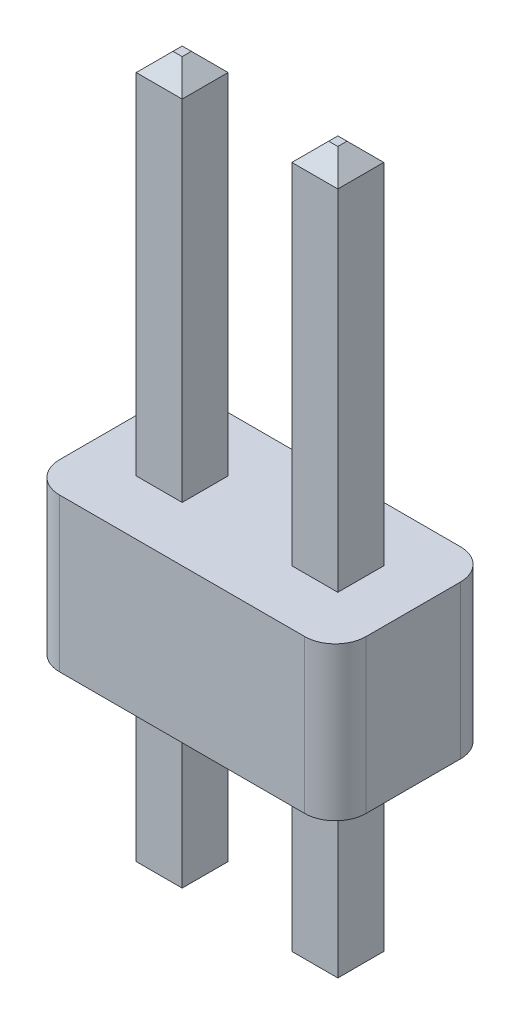
ISO-10303-21;
HEADER;
FILE_DESCRIPTION(('STEP AP214'),'2;1');
FILE_NAME('part.step','',(''),(''),'','','');
FILE_SCHEMA(('AUTOMOTIVE_DESIGN { 1 0 10303 214 1 1 1 1 }'));
ENDSEC;
DATA;
#1=APPLICATION_CONTEXT('core data for automotive mechanical design processes');
#2=APPLICATION_PROTOCOL_DEFINITION('international standard','automotive_design',2000,#1);
#3=PRODUCT_CONTEXT('',#1,'mechanical');
#4=PRODUCT('Part','Part','',(#3));
#5=PRODUCT_RELATED_PRODUCT_CATEGORY('part','',(#4));
#6=PRODUCT_DEFINITION_FORMATION('','',#4);
#7=PRODUCT_DEFINITION_CONTEXT('part definition',#1,'design');
#8=PRODUCT_DEFINITION('design','',#6,#7);
#9=PRODUCT_DEFINITION_SHAPE('','',#8);
#10=(LENGTH_UNIT() NAMED_UNIT(*) SI_UNIT(.MILLI.,.METRE.));
#11=(NAMED_UNIT(*) PLANE_ANGLE_UNIT() SI_UNIT($,.RADIAN.));
#12=(NAMED_UNIT(*) SI_UNIT($,.STERADIAN.) SOLID_ANGLE_UNIT());
#13=UNCERTAINTY_MEASURE_WITH_UNIT(LENGTH_MEASURE(1.E-05),#10,'distance_accuracy_value','');
#14=(GEOMETRIC_REPRESENTATION_CONTEXT(3) GLOBAL_UNCERTAINTY_ASSIGNED_CONTEXT((#13)) GLOBAL_UNIT_ASSIGNED_CONTEXT((#10,
#11,#12)) REPRESENTATION_CONTEXT('',''));
#15=CARTESIAN_POINT('',(0.,0.,0.));
#16=DIRECTION('',(0.,0.,1.));
#17=DIRECTION('',(1.,0.,0.));
#18=AXIS2_PLACEMENT_3D('',#15,#16,#17);
#19=CARTESIAN_POINT('',(2.,2.5,0.77));
#20=DIRECTION('',(0.,-1.,0.));
#21=DIRECTION('',(0.,0.,-1.));
#22=AXIS2_PLACEMENT_3D('',#19,#20,#21);
#23=CYLINDRICAL_SURFACE('',#22,0.5);
#24=CARTESIAN_POINT('',(2.,0.,0.77));
#25=DIRECTION('',(0.,1.,0.));
#26=DIRECTION('',(0.,0.,1.));
#27=AXIS2_PLACEMENT_3D('',#24,#25,#26);
#28=CIRCLE('',#27,0.5);
#29=CARTESIAN_POINT('',(2.,0.,1.27));
#30=VERTEX_POINT('',#29);
#31=CARTESIAN_POINT('',(2.5,0.,0.77));
#32=VERTEX_POINT('',#31);
#33=EDGE_CURVE('E302',#30,#32,#28,.T.);
#34=ORIENTED_EDGE('',*,*,#33,.T.);
#35=DIRECTION('',(0.,-1.,0.));
#36=VECTOR('',#35,1.);
#37=CARTESIAN_POINT('',(2.5,2.5,0.77));
#38=LINE('',#37,#36);
#39=CARTESIAN_POINT('',(2.5,2.5,0.77));
#40=VERTEX_POINT('',#39);
#41=EDGE_CURVE('E357',#40,#32,#38,.T.);
#42=ORIENTED_EDGE('',*,*,#41,.F.);
#43=CARTESIAN_POINT('',(2.,2.5,0.77));
#44=DIRECTION('',(0.,1.,0.));
#45=DIRECTION('',(0.,0.,1.));
#46=AXIS2_PLACEMENT_3D('',#43,#44,#45);
#47=CIRCLE('',#46,0.5);
#48=CARTESIAN_POINT('',(2.,2.5,1.27));
#49=VERTEX_POINT('',#48);
#50=EDGE_CURVE('E303',#49,#40,#47,.T.);
#51=ORIENTED_EDGE('',*,*,#50,.F.);
#52=DIRECTION('',(0.,-1.,0.));
#53=VECTOR('',#52,1.);
#54=CARTESIAN_POINT('',(2.,2.5,1.27));
#55=LINE('',#54,#53);
#56=EDGE_CURVE('E321',#49,#30,#55,.T.);
#57=ORIENTED_EDGE('',*,*,#56,.T.);
#58=EDGE_LOOP('',(#34,#42,#51,#57));
#59=FACE_BOUND('',#58,.T.);
#60=ADVANCED_FACE('F36',(#59),#23,.T.);
#61=CARTESIAN_POINT('',(2.5,2.5,-0.77));
#62=DIRECTION('',(-1.,0.,0.));
#63=DIRECTION('',(0.,0.,1.));
#64=AXIS2_PLACEMENT_3D('',#61,#62,#63);
#65=PLANE('',#64);
#66=DIRECTION('',(0.,0.,-1.));
#67=VECTOR('',#66,1.);
#68=CARTESIAN_POINT('',(2.5,0.,-0.77));
#69=LINE('',#68,#67);
#70=CARTESIAN_POINT('',(2.5,0.,-0.77));
#71=VERTEX_POINT('',#70);
#72=EDGE_CURVE('E324',#32,#71,#69,.T.);
#73=ORIENTED_EDGE('',*,*,#72,.T.);
#74=DIRECTION('',(0.,-1.,0.));
#75=VECTOR('',#74,1.);
#76=CARTESIAN_POINT('',(2.5,2.5,-0.77));
#77=LINE('',#76,#75);
#78=CARTESIAN_POINT('',(2.5,2.5,-0.77));
#79=VERTEX_POINT('',#78);
#80=EDGE_CURVE('E354',#79,#71,#77,.T.);
#81=ORIENTED_EDGE('',*,*,#80,.F.);
#82=DIRECTION('',(0.,0.,-1.));
#83=VECTOR('',#82,1.);
#84=CARTESIAN_POINT('',(2.5,2.5,-0.77));
#85=LINE('',#84,#83);
#86=EDGE_CURVE('E306',#40,#79,#85,.T.);
#87=ORIENTED_EDGE('',*,*,#86,.F.);
#88=ORIENTED_EDGE('',*,*,#41,.T.);
#89=EDGE_LOOP('',(#73,#81,#87,#88));
#90=FACE_BOUND('',#89,.T.);
#91=ADVANCED_FACE('F523',(#90),#65,.F.);
#92=CARTESIAN_POINT('',(2.,2.5,-0.77));
#93=DIRECTION('',(0.,-1.,0.));
#94=DIRECTION('',(0.,0.,-1.));
#95=AXIS2_PLACEMENT_3D('',#92,#93,#94);
#96=CYLINDRICAL_SURFACE('',#95,0.5);
#97=CARTESIAN_POINT('',(2.,0.,-0.77));
#98=DIRECTION('',(0.,1.,0.));
#99=DIRECTION('',(0.,0.,1.));
#100=AXIS2_PLACEMENT_3D('',#97,#98,#99);
#101=CIRCLE('',#100,0.5);
#102=CARTESIAN_POINT('',(2.,0.,-1.27));
#103=VERTEX_POINT('',#102);
#104=EDGE_CURVE('E326',#71,#103,#101,.T.);
#105=ORIENTED_EDGE('',*,*,#104,.T.);
#106=DIRECTION('',(0.,-1.,0.));
#107=VECTOR('',#106,1.);
#108=CARTESIAN_POINT('',(2.,2.5,-1.27));
#109=LINE('',#108,#107);
#110=CARTESIAN_POINT('',(2.,2.5,-1.27));
#111=VERTEX_POINT('',#110);
#112=EDGE_CURVE('E351',#111,#103,#109,.T.);
#113=ORIENTED_EDGE('',*,*,#112,.F.);
#114=CARTESIAN_POINT('',(2.,2.5,-0.77));
#115=DIRECTION('',(0.,1.,0.));
#116=DIRECTION('',(0.,0.,1.));
#117=AXIS2_PLACEMENT_3D('',#114,#115,#116);
#118=CIRCLE('',#117,0.5);
#119=EDGE_CURVE('E309',#79,#111,#118,.T.);
#120=ORIENTED_EDGE('',*,*,#119,.F.);
#121=ORIENTED_EDGE('',*,*,#80,.T.);
#122=EDGE_LOOP('',(#105,#113,#120,#121));
#123=FACE_BOUND('',#122,.T.);
#124=ADVANCED_FACE('F529',(#123),#96,.T.);
#125=CARTESIAN_POINT('',(-2.,2.5,-1.27));
#126=DIRECTION('',(0.,0.,1.));
#127=DIRECTION('',(1.,0.,0.));
#128=AXIS2_PLACEMENT_3D('',#125,#126,#127);
#129=PLANE('',#128);
#130=DIRECTION('',(-1.,0.,0.));
#131=VECTOR('',#130,1.);
#132=CARTESIAN_POINT('',(-2.,0.,-1.27));
#133=LINE('',#132,#131);
#134=CARTESIAN_POINT('',(-2.,0.,-1.27));
#135=VERTEX_POINT('',#134);
#136=EDGE_CURVE('E328',#103,#135,#133,.T.);
#137=ORIENTED_EDGE('',*,*,#136,.T.);
#138=DIRECTION('',(0.,-1.,0.));
#139=VECTOR('',#138,1.);
#140=CARTESIAN_POINT('',(-2.,2.5,-1.27));
#141=LINE('',#140,#139);
#142=CARTESIAN_POINT('',(-2.,2.5,-1.27));
#143=VERTEX_POINT('',#142);
#144=EDGE_CURVE('E348',#143,#135,#141,.T.);
#145=ORIENTED_EDGE('',*,*,#144,.F.);
#146=DIRECTION('',(-1.,0.,0.));
#147=VECTOR('',#146,1.);
#148=CARTESIAN_POINT('',(-2.,2.5,-1.27));
#149=LINE('',#148,#147);
#150=EDGE_CURVE('E311',#111,#143,#149,.T.);
#151=ORIENTED_EDGE('',*,*,#150,.F.);
#152=ORIENTED_EDGE('',*,*,#112,.T.);
#153=EDGE_LOOP('',(#137,#145,#151,#152));
#154=FACE_BOUND('',#153,.T.);
#155=ADVANCED_FACE('F873',(#154),#129,.F.);
#156=CARTESIAN_POINT('',(-2.,2.5,-0.77));
#157=DIRECTION('',(0.,-1.,0.));
#158=DIRECTION('',(0.,0.,-1.));
#159=AXIS2_PLACEMENT_3D('',#156,#157,#158);
#160=CYLINDRICAL_SURFACE('',#159,0.5);
#161=CARTESIAN_POINT('',(-2.,0.,-0.77));
#162=DIRECTION('',(0.,1.,0.));
#163=DIRECTION('',(0.,0.,1.));
#164=AXIS2_PLACEMENT_3D('',#161,#162,#163);
#165=CIRCLE('',#164,0.5);
#166=CARTESIAN_POINT('',(-2.5,0.,-0.77));
#167=VERTEX_POINT('',#166);
#168=EDGE_CURVE('E330',#135,#167,#165,.T.);
#169=ORIENTED_EDGE('',*,*,#168,.T.);
#170=DIRECTION('',(0.,-1.,0.));
#171=VECTOR('',#170,1.);
#172=CARTESIAN_POINT('',(-2.5,2.5,-0.77));
#173=LINE('',#172,#171);
#174=CARTESIAN_POINT('',(-2.5,2.5,-0.77));
#175=VERTEX_POINT('',#174);
#176=EDGE_CURVE('E345',#175,#167,#173,.T.);
#177=ORIENTED_EDGE('',*,*,#176,.F.);
#178=CARTESIAN_POINT('',(-2.,2.5,-0.77));
#179=DIRECTION('',(0.,1.,0.));
#180=DIRECTION('',(0.,0.,1.));
#181=AXIS2_PLACEMENT_3D('',#178,#179,#180);
#182=CIRCLE('',#181,0.5);
#183=EDGE_CURVE('E313',#143,#175,#182,.T.);
#184=ORIENTED_EDGE('',*,*,#183,.F.);
#185=ORIENTED_EDGE('',*,*,#144,.T.);
#186=EDGE_LOOP('',(#169,#177,#184,#185));
#187=FACE_BOUND('',#186,.T.);
#188=ADVANCED_FACE('F862',(#187),#160,.T.);
#189=CARTESIAN_POINT('',(-2.5,2.5,0.77));
#190=DIRECTION('',(1.,0.,0.));
#191=DIRECTION('',(0.,0.,-1.));
#192=AXIS2_PLACEMENT_3D('',#189,#190,#191);
#193=PLANE('',#192);
#194=DIRECTION('',(0.,0.,1.));
#195=VECTOR('',#194,1.);
#196=CARTESIAN_POINT('',(-2.5,0.,0.77));
#197=LINE('',#196,#195);
#198=CARTESIAN_POINT('',(-2.5,0.,0.77));
#199=VERTEX_POINT('',#198);
#200=EDGE_CURVE('E332',#167,#199,#197,.T.);
#201=ORIENTED_EDGE('',*,*,#200,.T.);
#202=DIRECTION('',(0.,-1.,0.));
#203=VECTOR('',#202,1.);
#204=CARTESIAN_POINT('',(-2.5,2.5,0.77));
#205=LINE('',#204,#203);
#206=CARTESIAN_POINT('',(-2.5,2.5,0.77));
#207=VERTEX_POINT('',#206);
#208=EDGE_CURVE('E342',#207,#199,#205,.T.);
#209=ORIENTED_EDGE('',*,*,#208,.F.);
#210=DIRECTION('',(0.,0.,1.));
#211=VECTOR('',#210,1.);
#212=CARTESIAN_POINT('',(-2.5,2.5,0.77));
#213=LINE('',#212,#211);
#214=EDGE_CURVE('E315',#175,#207,#213,.T.);
#215=ORIENTED_EDGE('',*,*,#214,.F.);
#216=ORIENTED_EDGE('',*,*,#176,.T.);
#217=EDGE_LOOP('',(#201,#209,#215,#216));
#218=FACE_BOUND('',#217,.T.);
#219=ADVANCED_FACE('F851',(#218),#193,.F.);
#220=CARTESIAN_POINT('',(-2.,2.5,0.77));
#221=DIRECTION('',(0.,-1.,0.));
#222=DIRECTION('',(0.,0.,-1.));
#223=AXIS2_PLACEMENT_3D('',#220,#221,#222);
#224=CYLINDRICAL_SURFACE('',#223,0.5);
#225=CARTESIAN_POINT('',(-2.,0.,0.77));
#226=DIRECTION('',(0.,1.,0.));
#227=DIRECTION('',(0.,0.,1.));
#228=AXIS2_PLACEMENT_3D('',#225,#226,#227);
#229=CIRCLE('',#228,0.5);
#230=CARTESIAN_POINT('',(-2.,0.,1.27));
#231=VERTEX_POINT('',#230);
#232=EDGE_CURVE('E334',#199,#231,#229,.T.);
#233=ORIENTED_EDGE('',*,*,#232,.T.);
#234=DIRECTION('',(0.,-1.,0.));
#235=VECTOR('',#234,1.);
#236=CARTESIAN_POINT('',(-2.,2.5,1.27));
#237=LINE('',#236,#235);
#238=CARTESIAN_POINT('',(-2.,2.5,1.27));
#239=VERTEX_POINT('',#238);
#240=EDGE_CURVE('E339',#239,#231,#237,.T.);
#241=ORIENTED_EDGE('',*,*,#240,.F.);
#242=CARTESIAN_POINT('',(-2.,2.5,0.77));
#243=DIRECTION('',(0.,1.,0.));
#244=DIRECTION('',(0.,0.,1.));
#245=AXIS2_PLACEMENT_3D('',#242,#243,#244);
#246=CIRCLE('',#245,0.5);
#247=EDGE_CURVE('E317',#207,#239,#246,.T.);
#248=ORIENTED_EDGE('',*,*,#247,.F.);
#249=ORIENTED_EDGE('',*,*,#208,.T.);
#250=EDGE_LOOP('',(#233,#241,#248,#249));
#251=FACE_BOUND('',#250,.T.);
#252=ADVANCED_FACE('F840',(#251),#224,.T.);
#253=CARTESIAN_POINT('',(2.,2.5,1.27));
#254=DIRECTION('',(0.,0.,-1.));
#255=DIRECTION('',(-1.,0.,0.));
#256=AXIS2_PLACEMENT_3D('',#253,#254,#255);
#257=PLANE('',#256);
#258=DIRECTION('',(1.,0.,0.));
#259=VECTOR('',#258,1.);
#260=CARTESIAN_POINT('',(2.,0.,1.27));
#261=LINE('',#260,#259);
#262=EDGE_CURVE('E307',#231,#30,#261,.T.);
#263=ORIENTED_EDGE('',*,*,#262,.T.);
#264=ORIENTED_EDGE('',*,*,#56,.F.);
#265=DIRECTION('',(1.,0.,0.));
#266=VECTOR('',#265,1.);
#267=CARTESIAN_POINT('',(2.,2.5,1.27));
#268=LINE('',#267,#266);
#269=EDGE_CURVE('E319',#239,#49,#268,.T.);
#270=ORIENTED_EDGE('',*,*,#269,.F.);
#271=ORIENTED_EDGE('',*,*,#240,.T.);
#272=EDGE_LOOP('',(#263,#264,#270,#271));
#273=FACE_BOUND('',#272,.T.);
#274=ADVANCED_FACE('F830',(#273),#257,.F.);
#275=CARTESIAN_POINT('',(2.,2.5,0.77));
#276=DIRECTION('',(0.,1.,0.));
#277=DIRECTION('',(0.,0.,1.));
#278=AXIS2_PLACEMENT_3D('',#275,#276,#277);
#279=PLANE('',#278);
#280=DIRECTION('',(0.,0.,1.));
#281=VECTOR('',#280,1.);
#282=CARTESIAN_POINT('',(0.895,2.5,0.77));
#283=LINE('',#282,#281);
#284=CARTESIAN_POINT('',(0.895,2.5,-0.375));
#285=VERTEX_POINT('',#284);
#286=CARTESIAN_POINT('',(0.895,2.5,0.375));
#287=VERTEX_POINT('',#286);
#288=EDGE_CURVE('E276',#285,#287,#283,.T.);
#289=ORIENTED_EDGE('',*,*,#288,.F.);
#290=DIRECTION('',(-1.,0.,0.));
#291=VECTOR('',#290,1.);
#292=CARTESIAN_POINT('',(2.,2.5,-0.375));
#293=LINE('',#292,#291);
#294=CARTESIAN_POINT('',(1.645,2.5,-0.375));
#295=VERTEX_POINT('',#294);
#296=EDGE_CURVE('E254',#295,#285,#293,.T.);
#297=ORIENTED_EDGE('',*,*,#296,.F.);
#298=DIRECTION('',(0.,0.,-1.));
#299=VECTOR('',#298,1.);
#300=CARTESIAN_POINT('',(1.645,2.5,0.77));
#301=LINE('',#300,#299);
#302=CARTESIAN_POINT('',(1.645,2.5,0.375));
#303=VERTEX_POINT('',#302);
#304=EDGE_CURVE('E247',#303,#295,#301,.T.);
#305=ORIENTED_EDGE('',*,*,#304,.F.);
#306=DIRECTION('',(1.,0.,0.));
#307=VECTOR('',#306,1.);
#308=CARTESIAN_POINT('',(2.,2.5,0.375));
#309=LINE('',#308,#307);
#310=EDGE_CURVE('E251',#287,#303,#309,.T.);
#311=ORIENTED_EDGE('',*,*,#310,.F.);
#312=EDGE_LOOP('',(#289,#297,#305,#311));
#313=FACE_BOUND('',#312,.T.);
#314=DIRECTION('',(0.,0.,-1.));
#315=VECTOR('',#314,1.);
#316=CARTESIAN_POINT('',(-0.895,2.5,0.77));
#317=LINE('',#316,#315);
#318=CARTESIAN_POINT('',(-0.895,2.5,0.375));
#319=VERTEX_POINT('',#318);
#320=CARTESIAN_POINT('',(-0.895,2.5,-0.375));
#321=VERTEX_POINT('',#320);
#322=EDGE_CURVE('E299',#319,#321,#317,.T.);
#323=ORIENTED_EDGE('',*,*,#322,.F.);
#324=DIRECTION('',(1.,0.,0.));
#325=VECTOR('',#324,1.);
#326=CARTESIAN_POINT('',(2.,2.5,0.375));
#327=LINE('',#326,#325);
#328=CARTESIAN_POINT('',(-1.645,2.5,0.375));
#329=VERTEX_POINT('',#328);
#330=EDGE_CURVE('E296',#329,#319,#327,.T.);
#331=ORIENTED_EDGE('',*,*,#330,.F.);
#332=DIRECTION('',(0.,0.,1.));
#333=VECTOR('',#332,1.);
#334=CARTESIAN_POINT('',(-1.645,2.5,0.77));
#335=LINE('',#334,#333);
#336=CARTESIAN_POINT('',(-1.645,2.5,-0.375));
#337=VERTEX_POINT('',#336);
#338=EDGE_CURVE('E293',#337,#329,#335,.T.);
#339=ORIENTED_EDGE('',*,*,#338,.F.);
#340=DIRECTION('',(-1.,0.,0.));
#341=VECTOR('',#340,1.);
#342=CARTESIAN_POINT('',(2.,2.5,-0.375));
#343=LINE('',#342,#341);
#344=EDGE_CURVE('E281',#321,#337,#343,.T.);
#345=ORIENTED_EDGE('',*,*,#344,.F.);
#346=EDGE_LOOP('',(#323,#331,#339,#345));
#347=FACE_BOUND('',#346,.T.);
#348=ORIENTED_EDGE('',*,*,#50,.T.);
#349=ORIENTED_EDGE('',*,*,#86,.T.);
#350=ORIENTED_EDGE('',*,*,#119,.T.);
#351=ORIENTED_EDGE('',*,*,#150,.T.);
#352=ORIENTED_EDGE('',*,*,#183,.T.);
#353=ORIENTED_EDGE('',*,*,#214,.T.);
#354=ORIENTED_EDGE('',*,*,#247,.T.);
#355=ORIENTED_EDGE('',*,*,#269,.T.);
#356=EDGE_LOOP('',(#348,#349,#350,#351,#352,#353,#354,#355));
#357=FACE_BOUND('',#356,.T.);
#358=ADVANCED_FACE('F249',(#313,#347,#357),#279,.T.);
#359=CARTESIAN_POINT('',(2.,0.,0.77));
#360=DIRECTION('',(0.,1.,0.));
#361=DIRECTION('',(0.,0.,1.));
#362=AXIS2_PLACEMENT_3D('',#359,#360,#361);
#363=PLANE('',#362);
#364=DIRECTION('',(-1.,0.,0.));
#365=VECTOR('',#364,1.);
#366=CARTESIAN_POINT('',(2.,0.,-0.375));
#367=LINE('',#366,#365);
#368=CARTESIAN_POINT('',(1.645,0.,-0.375));
#369=VERTEX_POINT('',#368);
#370=CARTESIAN_POINT('',(0.895,0.,-0.375));
#371=VERTEX_POINT('',#370);
#372=EDGE_CURVE('E378',#369,#371,#367,.T.);
#373=ORIENTED_EDGE('',*,*,#372,.T.);
#374=DIRECTION('',(0.,0.,1.));
#375=VECTOR('',#374,1.);
#376=CARTESIAN_POINT('',(0.895,0.,0.77));
#377=LINE('',#376,#375);
#378=CARTESIAN_POINT('',(0.895,0.,0.375));
#379=VERTEX_POINT('',#378);
#380=EDGE_CURVE('E381',#371,#379,#377,.T.);
#381=ORIENTED_EDGE('',*,*,#380,.T.);
#382=DIRECTION('',(1.,0.,0.));
#383=VECTOR('',#382,1.);
#384=CARTESIAN_POINT('',(2.,0.,0.375));
#385=LINE('',#384,#383);
#386=CARTESIAN_POINT('',(1.645,0.,0.375));
#387=VERTEX_POINT('',#386);
#388=EDGE_CURVE('E372',#379,#387,#385,.T.);
#389=ORIENTED_EDGE('',*,*,#388,.T.);
#390=DIRECTION('',(0.,0.,-1.));
#391=VECTOR('',#390,1.);
#392=CARTESIAN_POINT('',(1.645,0.,0.77));
#393=LINE('',#392,#391);
#394=EDGE_CURVE('E375',#387,#369,#393,.T.);
#395=ORIENTED_EDGE('',*,*,#394,.T.);
#396=EDGE_LOOP('',(#373,#381,#389,#395));
#397=FACE_BOUND('',#396,.T.);
#398=DIRECTION('',(1.,0.,0.));
#399=VECTOR('',#398,1.);
#400=CARTESIAN_POINT('',(2.,0.,0.375));
#401=LINE('',#400,#399);
#402=CARTESIAN_POINT('',(-1.645,0.,0.375));
#403=VERTEX_POINT('',#402);
#404=CARTESIAN_POINT('',(-0.895,0.,0.375));
#405=VERTEX_POINT('',#404);
#406=EDGE_CURVE('E366',#403,#405,#401,.T.);
#407=ORIENTED_EDGE('',*,*,#406,.T.);
#408=DIRECTION('',(0.,0.,-1.));
#409=VECTOR('',#408,1.);
#410=CARTESIAN_POINT('',(-0.895,0.,0.77));
#411=LINE('',#410,#409);
#412=CARTESIAN_POINT('',(-0.895,0.,-0.375));
#413=VERTEX_POINT('',#412);
#414=EDGE_CURVE('E369',#405,#413,#411,.T.);
#415=ORIENTED_EDGE('',*,*,#414,.T.);
#416=DIRECTION('',(-1.,0.,0.));
#417=VECTOR('',#416,1.);
#418=CARTESIAN_POINT('',(2.,0.,-0.375));
#419=LINE('',#418,#417);
#420=CARTESIAN_POINT('',(-1.645,0.,-0.375));
#421=VERTEX_POINT('',#420);
#422=EDGE_CURVE('E360',#413,#421,#419,.T.);
#423=ORIENTED_EDGE('',*,*,#422,.T.);
#424=DIRECTION('',(0.,0.,1.));
#425=VECTOR('',#424,1.);
#426=CARTESIAN_POINT('',(-1.645,0.,0.77));
#427=LINE('',#426,#425);
#428=EDGE_CURVE('E363',#421,#403,#427,.T.);
#429=ORIENTED_EDGE('',*,*,#428,.T.);
#430=EDGE_LOOP('',(#407,#415,#423,#429));
#431=FACE_BOUND('',#430,.T.);
#432=ORIENTED_EDGE('',*,*,#33,.F.);
#433=ORIENTED_EDGE('',*,*,#262,.F.);
#434=ORIENTED_EDGE('',*,*,#232,.F.);
#435=ORIENTED_EDGE('',*,*,#200,.F.);
#436=ORIENTED_EDGE('',*,*,#168,.F.);
#437=ORIENTED_EDGE('',*,*,#136,.F.);
#438=ORIENTED_EDGE('',*,*,#104,.F.);
#439=ORIENTED_EDGE('',*,*,#72,.F.);
#440=EDGE_LOOP('',(#432,#433,#434,#435,#436,#437,#438,#439));
#441=FACE_BOUND('',#440,.T.);
#442=ADVANCED_FACE('F809',(#397,#431,#441),#363,.F.);
#443=CARTESIAN_POINT('',(0.,-3.25,0.));
#444=DIRECTION('',(0.,-1.,0.));
#445=DIRECTION('',(0.,0.,-1.));
#446=AXIS2_PLACEMENT_3D('',#443,#444,#445);
#447=PLANE('',#446);
#448=DIRECTION('',(0.,0.,1.));
#449=VECTOR('',#448,1.);
#450=CARTESIAN_POINT('',(-1.195,-3.25,0.));
#451=LINE('',#450,#449);
#452=CARTESIAN_POINT('',(-1.195,-3.25,-0.0750000000000004));
#453=VERTEX_POINT('',#452);
#454=CARTESIAN_POINT('',(-1.195,-3.25,0.075));
#455=VERTEX_POINT('',#454);
#456=EDGE_CURVE('E407',#453,#455,#451,.T.);
#457=ORIENTED_EDGE('',*,*,#456,.T.);
#458=DIRECTION('',(-1.,0.,0.));
#459=VECTOR('',#458,1.);
#460=CARTESIAN_POINT('',(0.,-3.25,0.075));
#461=LINE('',#460,#459);
#462=CARTESIAN_POINT('',(-1.345,-3.25,0.075));
#463=VERTEX_POINT('',#462);
#464=EDGE_CURVE('E411',#455,#463,#461,.T.);
#465=ORIENTED_EDGE('',*,*,#464,.T.);
#466=DIRECTION('',(0.,0.,-1.));
#467=VECTOR('',#466,1.);
#468=CARTESIAN_POINT('',(-1.345,-3.25,0.));
#469=LINE('',#468,#467);
#470=CARTESIAN_POINT('',(-1.345,-3.25,-0.0750000000000004));
#471=VERTEX_POINT('',#470);
#472=EDGE_CURVE('E409',#463,#471,#469,.T.);
#473=ORIENTED_EDGE('',*,*,#472,.T.);
#474=DIRECTION('',(1.,0.,0.));
#475=VECTOR('',#474,1.);
#476=CARTESIAN_POINT('',(0.,-3.25,-0.0750000000000004));
#477=LINE('',#476,#475);
#478=EDGE_CURVE('E405',#471,#453,#477,.T.);
#479=ORIENTED_EDGE('',*,*,#478,.T.);
#480=EDGE_LOOP('',(#457,#465,#473,#479));
#481=FACE_BOUND('',#480,.T.);
#482=ADVANCED_FACE('F800',(#481),#447,.T.);
#483=CARTESIAN_POINT('',(-1.645,-3.25,-0.375));
#484=DIRECTION('',(0.,0.,-1.));
#485=DIRECTION('',(-1.,0.,0.));
#486=AXIS2_PLACEMENT_3D('',#483,#484,#485);
#487=PLANE('',#486);
#488=DIRECTION('',(0.,1.,0.));
#489=VECTOR('',#488,1.);
#490=CARTESIAN_POINT('',(-0.895,-3.25,-0.375));
#491=LINE('',#490,#489);
#492=CARTESIAN_POINT('',(-0.895,-2.95,-0.375));
#493=VERTEX_POINT('',#492);
#494=EDGE_CURVE('E289',#493,#413,#491,.T.);
#495=ORIENTED_EDGE('',*,*,#494,.F.);
#496=DIRECTION('',(-1.,0.,0.));
#497=VECTOR('',#496,1.);
#498=CARTESIAN_POINT('',(-1.645,-2.95,-0.375));
#499=LINE('',#498,#497);
#500=CARTESIAN_POINT('',(-1.645,-2.95,-0.375));
#501=VERTEX_POINT('',#500);
#502=EDGE_CURVE('E418',#493,#501,#499,.T.);
#503=ORIENTED_EDGE('',*,*,#502,.T.);
#504=DIRECTION('',(0.,1.,0.));
#505=VECTOR('',#504,1.);
#506=CARTESIAN_POINT('',(-1.645,-3.25,-0.375));
#507=LINE('',#506,#505);
#508=EDGE_CURVE('E286',#501,#421,#507,.T.);
#509=ORIENTED_EDGE('',*,*,#508,.T.);
#510=ORIENTED_EDGE('',*,*,#422,.F.);
#511=EDGE_LOOP('',(#495,#503,#509,#510));
#512=FACE_BOUND('',#511,.T.);
#513=ADVANCED_FACE('F736',(#512),#487,.T.);
#514=CARTESIAN_POINT('',(-1.645,-3.25,0.375));
#515=DIRECTION('',(-1.,0.,0.));
#516=DIRECTION('',(0.,0.,1.));
#517=AXIS2_PLACEMENT_3D('',#514,#515,#516);
#518=PLANE('',#517);
#519=ORIENTED_EDGE('',*,*,#508,.F.);
#520=DIRECTION('',(0.,0.,1.));
#521=VECTOR('',#520,1.);
#522=CARTESIAN_POINT('',(-1.645,-2.95,0.375));
#523=LINE('',#522,#521);
#524=CARTESIAN_POINT('',(-1.645,-2.95,0.375));
#525=VERTEX_POINT('',#524);
#526=EDGE_CURVE('E414',#501,#525,#523,.T.);
#527=ORIENTED_EDGE('',*,*,#526,.T.);
#528=DIRECTION('',(0.,1.,0.));
#529=VECTOR('',#528,1.);
#530=CARTESIAN_POINT('',(-1.645,-3.25,0.375));
#531=LINE('',#530,#529);
#532=EDGE_CURVE('E283',#525,#403,#531,.T.);
#533=ORIENTED_EDGE('',*,*,#532,.T.);
#534=ORIENTED_EDGE('',*,*,#428,.F.);
#535=EDGE_LOOP('',(#519,#527,#533,#534));
#536=FACE_BOUND('',#535,.T.);
#537=ADVANCED_FACE('F747',(#536),#518,.T.);
#538=CARTESIAN_POINT('',(-0.895,-3.25,0.375));
#539=DIRECTION('',(0.,0.,1.));
#540=DIRECTION('',(1.,0.,0.));
#541=AXIS2_PLACEMENT_3D('',#538,#539,#540);
#542=PLANE('',#541);
#543=ORIENTED_EDGE('',*,*,#532,.F.);
#544=DIRECTION('',(1.,0.,0.));
#545=VECTOR('',#544,1.);
#546=CARTESIAN_POINT('',(-0.895,-2.95,0.375));
#547=LINE('',#546,#545);
#548=CARTESIAN_POINT('',(-0.895,-2.95,0.375));
#549=VERTEX_POINT('',#548);
#550=EDGE_CURVE('E402',#525,#549,#547,.T.);
#551=ORIENTED_EDGE('',*,*,#550,.T.);
#552=DIRECTION('',(0.,1.,0.));
#553=VECTOR('',#552,1.);
#554=CARTESIAN_POINT('',(-0.895,-3.25,0.375));
#555=LINE('',#554,#553);
#556=EDGE_CURVE('E279',#549,#405,#555,.T.);
#557=ORIENTED_EDGE('',*,*,#556,.T.);
#558=ORIENTED_EDGE('',*,*,#406,.F.);
#559=EDGE_LOOP('',(#543,#551,#557,#558));
#560=FACE_BOUND('',#559,.T.);
#561=ADVANCED_FACE('F758',(#560),#542,.T.);
#562=CARTESIAN_POINT('',(-0.895,-3.25,-0.375));
#563=DIRECTION('',(1.,0.,0.));
#564=DIRECTION('',(0.,0.,-1.));
#565=AXIS2_PLACEMENT_3D('',#562,#563,#564);
#566=PLANE('',#565);
#567=ORIENTED_EDGE('',*,*,#556,.F.);
#568=DIRECTION('',(0.,0.,-1.));
#569=VECTOR('',#568,1.);
#570=CARTESIAN_POINT('',(-0.895,-2.95,-0.375));
#571=LINE('',#570,#569);
#572=EDGE_CURVE('E416',#549,#493,#571,.T.);
#573=ORIENTED_EDGE('',*,*,#572,.T.);
#574=ORIENTED_EDGE('',*,*,#494,.T.);
#575=ORIENTED_EDGE('',*,*,#414,.F.);
#576=EDGE_LOOP('',(#567,#573,#574,#575));
#577=FACE_BOUND('',#576,.T.);
#578=ADVANCED_FACE('F766',(#577),#566,.T.);
#579=CARTESIAN_POINT('',(-0.895,8.2,-0.375));
#580=VERTEX_POINT('',#579);
#581=EDGE_CURVE('E278',#321,#580,#491,.T.);
#582=ORIENTED_EDGE('',*,*,#581,.T.);
#583=DIRECTION('',(0.,0.,1.));
#584=VECTOR('',#583,1.);
#585=CARTESIAN_POINT('',(-0.895,8.2,0.375));
#586=LINE('',#585,#584);
#587=CARTESIAN_POINT('',(-0.895,8.2,0.375));
#588=VERTEX_POINT('',#587);
#589=EDGE_CURVE('E434',#580,#588,#586,.T.);
#590=ORIENTED_EDGE('',*,*,#589,.T.);
#591=EDGE_CURVE('E282',#319,#588,#555,.T.);
#592=ORIENTED_EDGE('',*,*,#591,.F.);
#593=ORIENTED_EDGE('',*,*,#322,.T.);
#594=EDGE_LOOP('',(#582,#590,#592,#593));
#595=FACE_BOUND('',#594,.T.);
#596=ADVANCED_FACE('F755',(#595),#566,.T.);
#597=ORIENTED_EDGE('',*,*,#591,.T.);
#598=DIRECTION('',(-1.,0.,0.));
#599=VECTOR('',#598,1.);
#600=CARTESIAN_POINT('',(-1.645,8.2,0.375));
#601=LINE('',#600,#599);
#602=CARTESIAN_POINT('',(-1.645,8.2,0.375));
#603=VERTEX_POINT('',#602);
#604=EDGE_CURVE('E436',#588,#603,#601,.T.);
#605=ORIENTED_EDGE('',*,*,#604,.T.);
#606=EDGE_CURVE('E285',#329,#603,#531,.T.);
#607=ORIENTED_EDGE('',*,*,#606,.F.);
#608=ORIENTED_EDGE('',*,*,#330,.T.);
#609=EDGE_LOOP('',(#597,#605,#607,#608));
#610=FACE_BOUND('',#609,.T.);
#611=ADVANCED_FACE('F744',(#610),#542,.T.);
#612=ORIENTED_EDGE('',*,*,#606,.T.);
#613=DIRECTION('',(0.,0.,-1.));
#614=VECTOR('',#613,1.);
#615=CARTESIAN_POINT('',(-1.645,8.2,-0.375));
#616=LINE('',#615,#614);
#617=CARTESIAN_POINT('',(-1.645,8.2,-0.375));
#618=VERTEX_POINT('',#617);
#619=EDGE_CURVE('E429',#603,#618,#616,.T.);
#620=ORIENTED_EDGE('',*,*,#619,.T.);
#621=EDGE_CURVE('E288',#337,#618,#507,.T.);
#622=ORIENTED_EDGE('',*,*,#621,.F.);
#623=ORIENTED_EDGE('',*,*,#338,.T.);
#624=EDGE_LOOP('',(#612,#620,#622,#623));
#625=FACE_BOUND('',#624,.T.);
#626=ADVANCED_FACE('F733',(#625),#518,.T.);
#627=ORIENTED_EDGE('',*,*,#621,.T.);
#628=DIRECTION('',(1.,0.,0.));
#629=VECTOR('',#628,1.);
#630=CARTESIAN_POINT('',(-0.895,8.2,-0.375));
#631=LINE('',#630,#629);
#632=EDGE_CURVE('E432',#618,#580,#631,.T.);
#633=ORIENTED_EDGE('',*,*,#632,.T.);
#634=ORIENTED_EDGE('',*,*,#581,.F.);
#635=ORIENTED_EDGE('',*,*,#344,.T.);
#636=EDGE_LOOP('',(#627,#633,#634,#635));
#637=FACE_BOUND('',#636,.T.);
#638=ADVANCED_FACE('F723',(#637),#487,.T.);
#639=CARTESIAN_POINT('',(0.,8.5,0.));
#640=DIRECTION('',(0.,-1.,0.));
#641=DIRECTION('',(0.,0.,-1.));
#642=AXIS2_PLACEMENT_3D('',#639,#640,#641);
#643=PLANE('',#642);
#644=DIRECTION('',(-1.,0.,0.));
#645=VECTOR('',#644,1.);
#646=CARTESIAN_POINT('',(-1.645,8.5,-0.0750000000000004));
#647=LINE('',#646,#645);
#648=CARTESIAN_POINT('',(-1.195,8.5,-0.0750000000000004));
#649=VERTEX_POINT('',#648);
#650=CARTESIAN_POINT('',(-1.345,8.5,-0.0750000000000004));
#651=VERTEX_POINT('',#650);
#652=EDGE_CURVE('E424',#649,#651,#647,.T.);
#653=ORIENTED_EDGE('',*,*,#652,.T.);
#654=DIRECTION('',(0.,0.,1.));
#655=VECTOR('',#654,1.);
#656=CARTESIAN_POINT('',(-1.345,8.5,0.375));
#657=LINE('',#656,#655);
#658=CARTESIAN_POINT('',(-1.345,8.5,0.075));
#659=VERTEX_POINT('',#658);
#660=EDGE_CURVE('E426',#651,#659,#657,.T.);
#661=ORIENTED_EDGE('',*,*,#660,.T.);
#662=DIRECTION('',(1.,0.,0.));
#663=VECTOR('',#662,1.);
#664=CARTESIAN_POINT('',(-0.895,8.5,0.075));
#665=LINE('',#664,#663);
#666=CARTESIAN_POINT('',(-1.195,8.5,0.075));
#667=VERTEX_POINT('',#666);
#668=EDGE_CURVE('E420',#659,#667,#665,.T.);
#669=ORIENTED_EDGE('',*,*,#668,.T.);
#670=DIRECTION('',(0.,0.,-1.));
#671=VECTOR('',#670,1.);
#672=CARTESIAN_POINT('',(-1.195,8.5,-0.375));
#673=LINE('',#672,#671);
#674=EDGE_CURVE('E422',#667,#649,#673,.T.);
#675=ORIENTED_EDGE('',*,*,#674,.T.);
#676=EDGE_LOOP('',(#653,#661,#669,#675));
#677=FACE_BOUND('',#676,.T.);
#678=ADVANCED_FACE('F714',(#677),#643,.F.);
#679=CARTESIAN_POINT('',(0.,-3.25,0.));
#680=DIRECTION('',(0.,-1.,0.));
#681=DIRECTION('',(0.,0.,-1.));
#682=AXIS2_PLACEMENT_3D('',#679,#680,#681);
#683=PLANE('',#682);
#684=DIRECTION('',(0.,0.,-1.));
#685=VECTOR('',#684,1.);
#686=CARTESIAN_POINT('',(1.195,-3.25,0.));
#687=LINE('',#686,#685);
#688=CARTESIAN_POINT('',(1.195,-3.25,0.0750000000000002));
#689=VERTEX_POINT('',#688);
#690=CARTESIAN_POINT('',(1.195,-3.25,-0.0750000000000004));
#691=VERTEX_POINT('',#690);
#692=EDGE_CURVE('E389',#689,#691,#687,.T.);
#693=ORIENTED_EDGE('',*,*,#692,.T.);
#694=DIRECTION('',(1.,0.,0.));
#695=VECTOR('',#694,1.);
#696=CARTESIAN_POINT('',(0.,-3.25,-0.0750000000000004));
#697=LINE('',#696,#695);
#698=CARTESIAN_POINT('',(1.345,-3.25,-0.0750000000000004));
#699=VERTEX_POINT('',#698);
#700=EDGE_CURVE('E393',#691,#699,#697,.T.);
#701=ORIENTED_EDGE('',*,*,#700,.T.);
#702=DIRECTION('',(0.,0.,1.));
#703=VECTOR('',#702,1.);
#704=CARTESIAN_POINT('',(1.345,-3.25,0.));
#705=LINE('',#704,#703);
#706=CARTESIAN_POINT('',(1.345,-3.25,0.0750000000000002));
#707=VERTEX_POINT('',#706);
#708=EDGE_CURVE('E391',#699,#707,#705,.T.);
#709=ORIENTED_EDGE('',*,*,#708,.T.);
#710=DIRECTION('',(-1.,0.,0.));
#711=VECTOR('',#710,1.);
#712=CARTESIAN_POINT('',(0.,-3.25,0.0750000000000002));
#713=LINE('',#712,#711);
#714=EDGE_CURVE('E387',#707,#689,#713,.T.);
#715=ORIENTED_EDGE('',*,*,#714,.T.);
#716=EDGE_LOOP('',(#693,#701,#709,#715));
#717=FACE_BOUND('',#716,.T.);
#718=ADVANCED_FACE('F705',(#717),#683,.T.);
#719=CARTESIAN_POINT('',(1.645,-3.25,0.375));
#720=DIRECTION('',(0.,0.,1.));
#721=DIRECTION('',(1.,0.,0.));
#722=AXIS2_PLACEMENT_3D('',#719,#720,#721);
#723=PLANE('',#722);
#724=DIRECTION('',(0.,1.,0.));
#725=VECTOR('',#724,1.);
#726=CARTESIAN_POINT('',(0.895,-3.25,0.375));
#727=LINE('',#726,#725);
#728=CARTESIAN_POINT('',(0.895,-2.95,0.375));
#729=VERTEX_POINT('',#728);
#730=EDGE_CURVE('E267',#729,#379,#727,.T.);
#731=ORIENTED_EDGE('',*,*,#730,.F.);
#732=DIRECTION('',(1.,0.,0.));
#733=VECTOR('',#732,1.);
#734=CARTESIAN_POINT('',(1.645,-2.95,0.375));
#735=LINE('',#734,#733);
#736=CARTESIAN_POINT('',(1.645,-2.95,0.375));
#737=VERTEX_POINT('',#736);
#738=EDGE_CURVE('E400',#729,#737,#735,.T.);
#739=ORIENTED_EDGE('',*,*,#738,.T.);
#740=DIRECTION('',(0.,1.,0.));
#741=VECTOR('',#740,1.);
#742=CARTESIAN_POINT('',(1.645,-3.25,0.375));
#743=LINE('',#742,#741);
#744=EDGE_CURVE('E266',#737,#387,#743,.T.);
#745=ORIENTED_EDGE('',*,*,#744,.T.);
#746=ORIENTED_EDGE('',*,*,#388,.F.);
#747=EDGE_LOOP('',(#731,#739,#745,#746));
#748=FACE_BOUND('',#747,.T.);
#749=ADVANCED_FACE('F520',(#748),#723,.T.);
#750=CARTESIAN_POINT('',(1.645,-3.25,-0.375));
#751=DIRECTION('',(1.,0.,0.));
#752=DIRECTION('',(0.,0.,-1.));
#753=AXIS2_PLACEMENT_3D('',#750,#751,#752);
#754=PLANE('',#753);
#755=ORIENTED_EDGE('',*,*,#744,.F.);
#756=DIRECTION('',(0.,0.,-1.));
#757=VECTOR('',#756,1.);
#758=CARTESIAN_POINT('',(1.645,-2.95,-0.375));
#759=LINE('',#758,#757);
#760=CARTESIAN_POINT('',(1.645,-2.95,-0.375));
#761=VERTEX_POINT('',#760);
#762=EDGE_CURVE('E396',#737,#761,#759,.T.);
#763=ORIENTED_EDGE('',*,*,#762,.T.);
#764=DIRECTION('',(0.,1.,0.));
#765=VECTOR('',#764,1.);
#766=CARTESIAN_POINT('',(1.645,-3.25,-0.375));
#767=LINE('',#766,#765);
#768=EDGE_CURVE('E272',#761,#369,#767,.T.);
#769=ORIENTED_EDGE('',*,*,#768,.T.);
#770=ORIENTED_EDGE('',*,*,#394,.F.);
#771=EDGE_LOOP('',(#755,#763,#769,#770));
#772=FACE_BOUND('',#771,.T.);
#773=ADVANCED_FACE('F655',(#772),#754,.T.);
#774=CARTESIAN_POINT('',(0.895,-3.25,-0.375));
#775=DIRECTION('',(0.,0.,-1.));
#776=DIRECTION('',(-1.,0.,0.));
#777=AXIS2_PLACEMENT_3D('',#774,#775,#776);
#778=PLANE('',#777);
#779=ORIENTED_EDGE('',*,*,#768,.F.);
#780=DIRECTION('',(-1.,0.,0.));
#781=VECTOR('',#780,1.);
#782=CARTESIAN_POINT('',(0.895,-2.95,-0.375));
#783=LINE('',#782,#781);
#784=CARTESIAN_POINT('',(0.895,-2.95,-0.375));
#785=VERTEX_POINT('',#784);
#786=EDGE_CURVE('E384',#761,#785,#783,.T.);
#787=ORIENTED_EDGE('',*,*,#786,.T.);
#788=DIRECTION('',(0.,1.,0.));
#789=VECTOR('',#788,1.);
#790=CARTESIAN_POINT('',(0.895,-3.25,-0.375));
#791=LINE('',#790,#789);
#792=EDGE_CURVE('E263',#785,#371,#791,.T.);
#793=ORIENTED_EDGE('',*,*,#792,.T.);
#794=ORIENTED_EDGE('',*,*,#372,.F.);
#795=EDGE_LOOP('',(#779,#787,#793,#794));
#796=FACE_BOUND('',#795,.T.);
#797=ADVANCED_FACE('F664',(#796),#778,.T.);
#798=CARTESIAN_POINT('',(0.895,-3.25,0.375));
#799=DIRECTION('',(-1.,0.,0.));
#800=DIRECTION('',(0.,0.,1.));
#801=AXIS2_PLACEMENT_3D('',#798,#799,#800);
#802=PLANE('',#801);
#803=ORIENTED_EDGE('',*,*,#792,.F.);
#804=DIRECTION('',(0.,0.,1.));
#805=VECTOR('',#804,1.);
#806=CARTESIAN_POINT('',(0.895,-2.95,0.375));
#807=LINE('',#806,#805);
#808=EDGE_CURVE('E398',#785,#729,#807,.T.);
#809=ORIENTED_EDGE('',*,*,#808,.T.);
#810=ORIENTED_EDGE('',*,*,#730,.T.);
#811=ORIENTED_EDGE('',*,*,#380,.F.);
#812=EDGE_LOOP('',(#803,#809,#810,#811));
#813=FACE_BOUND('',#812,.T.);
#814=ADVANCED_FACE('F672',(#813),#802,.T.);
#815=CARTESIAN_POINT('',(0.895,8.2,0.375));
#816=VERTEX_POINT('',#815);
#817=EDGE_CURVE('E262',#287,#816,#727,.T.);
#818=ORIENTED_EDGE('',*,*,#817,.T.);
#819=DIRECTION('',(0.,0.,-1.));
#820=VECTOR('',#819,1.);
#821=CARTESIAN_POINT('',(0.895,8.2,-0.375));
#822=LINE('',#821,#820);
#823=CARTESIAN_POINT('',(0.895,8.2,-0.375));
#824=VERTEX_POINT('',#823);
#825=EDGE_CURVE('E447',#816,#824,#822,.T.);
#826=ORIENTED_EDGE('',*,*,#825,.T.);
#827=EDGE_CURVE('E971',#285,#824,#791,.T.);
#828=ORIENTED_EDGE('',*,*,#827,.F.);
#829=ORIENTED_EDGE('',*,*,#288,.T.);
#830=EDGE_LOOP('',(#818,#826,#828,#829));
#831=FACE_BOUND('',#830,.T.);
#832=ADVANCED_FACE('F502',(#831),#802,.T.);
#833=ORIENTED_EDGE('',*,*,#827,.T.);
#834=DIRECTION('',(1.,0.,0.));
#835=VECTOR('',#834,1.);
#836=CARTESIAN_POINT('',(1.645,8.2,-0.375));
#837=LINE('',#836,#835);
#838=CARTESIAN_POINT('',(1.645,8.2,-0.375));
#839=VERTEX_POINT('',#838);
#840=EDGE_CURVE('E60',#824,#839,#837,.T.);
#841=ORIENTED_EDGE('',*,*,#840,.T.);
#842=EDGE_CURVE('E269',#295,#839,#767,.T.);
#843=ORIENTED_EDGE('',*,*,#842,.F.);
#844=ORIENTED_EDGE('',*,*,#296,.T.);
#845=EDGE_LOOP('',(#833,#841,#843,#844));
#846=FACE_BOUND('',#845,.T.);
#847=ADVANCED_FACE('F653',(#846),#778,.T.);
#848=ORIENTED_EDGE('',*,*,#842,.T.);
#849=DIRECTION('',(0.,0.,1.));
#850=VECTOR('',#849,1.);
#851=CARTESIAN_POINT('',(1.645,8.2,0.375));
#852=LINE('',#851,#850);
#853=CARTESIAN_POINT('',(1.645,8.2,0.375));
#854=VERTEX_POINT('',#853);
#855=EDGE_CURVE('E45',#839,#854,#852,.T.);
#856=ORIENTED_EDGE('',*,*,#855,.T.);
#857=EDGE_CURVE('E259',#303,#854,#743,.T.);
#858=ORIENTED_EDGE('',*,*,#857,.F.);
#859=ORIENTED_EDGE('',*,*,#304,.T.);
#860=EDGE_LOOP('',(#848,#856,#858,#859));
#861=FACE_BOUND('',#860,.T.);
#862=ADVANCED_FACE('F265',(#861),#754,.T.);
#863=ORIENTED_EDGE('',*,*,#857,.T.);
#864=DIRECTION('',(-1.,0.,0.));
#865=VECTOR('',#864,1.);
#866=CARTESIAN_POINT('',(0.895,8.2,0.375));
#867=LINE('',#866,#865);
#868=EDGE_CURVE('E11',#854,#816,#867,.T.);
#869=ORIENTED_EDGE('',*,*,#868,.T.);
#870=ORIENTED_EDGE('',*,*,#817,.F.);
#871=ORIENTED_EDGE('',*,*,#310,.T.);
#872=EDGE_LOOP('',(#863,#869,#870,#871));
#873=FACE_BOUND('',#872,.T.);
#874=ADVANCED_FACE('F258',(#873),#723,.T.);
#875=CARTESIAN_POINT('',(0.,8.5,0.));
#876=DIRECTION('',(0.,-1.,0.));
#877=DIRECTION('',(0.,0.,-1.));
#878=AXIS2_PLACEMENT_3D('',#875,#876,#877);
#879=PLANE('',#878);
#880=DIRECTION('',(-1.,0.,0.));
#881=VECTOR('',#880,1.);
#882=CARTESIAN_POINT('',(0.895,8.5,-0.0750000000000004));
#883=LINE('',#882,#881);
#884=CARTESIAN_POINT('',(1.345,8.5,-0.0750000000000004));
#885=VERTEX_POINT('',#884);
#886=CARTESIAN_POINT('',(1.195,8.5,-0.0750000000000004));
#887=VERTEX_POINT('',#886);
#888=EDGE_CURVE('E442',#885,#887,#883,.T.);
#889=ORIENTED_EDGE('',*,*,#888,.T.);
#890=DIRECTION('',(0.,0.,1.));
#891=VECTOR('',#890,1.);
#892=CARTESIAN_POINT('',(1.195,8.5,0.375));
#893=LINE('',#892,#891);
#894=CARTESIAN_POINT('',(1.195,8.5,0.0750000000000001));
#895=VERTEX_POINT('',#894);
#896=EDGE_CURVE('E444',#887,#895,#893,.T.);
#897=ORIENTED_EDGE('',*,*,#896,.T.);
#898=DIRECTION('',(1.,0.,0.));
#899=VECTOR('',#898,1.);
#900=CARTESIAN_POINT('',(1.645,8.5,0.0750000000000001));
#901=LINE('',#900,#899);
#902=CARTESIAN_POINT('',(1.345,8.5,0.0750000000000001));
#903=VERTEX_POINT('',#902);
#904=EDGE_CURVE('E438',#895,#903,#901,.T.);
#905=ORIENTED_EDGE('',*,*,#904,.T.);
#906=DIRECTION('',(0.,0.,-1.));
#907=VECTOR('',#906,1.);
#908=CARTESIAN_POINT('',(1.345,8.5,-0.375));
#909=LINE('',#908,#907);
#910=EDGE_CURVE('E440',#903,#885,#909,.T.);
#911=ORIENTED_EDGE('',*,*,#910,.T.);
#912=EDGE_LOOP('',(#889,#897,#905,#911));
#913=FACE_BOUND('',#912,.T.);
#914=ADVANCED_FACE('F508',(#913),#879,.F.);
#915=CARTESIAN_POINT('',(1.645,-2.95,0.375));
#916=DIRECTION('',(0.,0.707106781186543,-0.707106781186552));
#917=DIRECTION('',(1.,0.,0.));
#918=AXIS2_PLACEMENT_3D('',#915,#916,#917);
#919=PLANE('',#918);
#920=DIRECTION('',(0.577350269189624,-0.57735026918963,-0.577350269189623));
#921=VECTOR('',#920,1.);
#922=CARTESIAN_POINT('',(1.145,-3.2,0.125000000000002));
#923=LINE('',#922,#921);
#924=EDGE_CURVE('E457',#689,#729,#923,.F.);
#925=ORIENTED_EDGE('',*,*,#924,.F.);
#926=ORIENTED_EDGE('',*,*,#714,.F.);
#927=DIRECTION('',(0.577350269189624,0.57735026918963,0.577350269189623));
#928=VECTOR('',#927,1.);
#929=CARTESIAN_POINT('',(1.645,-2.95,0.375));
#930=LINE('',#929,#928);
#931=EDGE_CURVE('E460',#737,#707,#930,.F.);
#932=ORIENTED_EDGE('',*,*,#931,.F.);
#933=ORIENTED_EDGE('',*,*,#738,.F.);
#934=EDGE_LOOP('',(#925,#926,#932,#933));
#935=FACE_BOUND('',#934,.T.);
#936=ADVANCED_FACE('F510',(#935),#919,.F.);
#937=CARTESIAN_POINT('',(1.645,-2.95,-0.375));
#938=DIRECTION('',(-0.707106781186552,0.707106781186544,0.));
#939=DIRECTION('',(0.,0.,-1.));
#940=AXIS2_PLACEMENT_3D('',#937,#938,#939);
#941=PLANE('',#940);
#942=ORIENTED_EDGE('',*,*,#931,.T.);
#943=ORIENTED_EDGE('',*,*,#708,.F.);
#944=DIRECTION('',(0.577350269189624,0.57735026918963,-0.577350269189623));
#945=VECTOR('',#944,1.);
#946=CARTESIAN_POINT('',(1.645,-2.95,-0.375));
#947=LINE('',#946,#945);
#948=EDGE_CURVE('E454',#761,#699,#947,.F.);
#949=ORIENTED_EDGE('',*,*,#948,.F.);
#950=ORIENTED_EDGE('',*,*,#762,.F.);
#951=EDGE_LOOP('',(#942,#943,#949,#950));
#952=FACE_BOUND('',#951,.T.);
#953=ADVANCED_FACE('F516',(#952),#941,.F.);
#954=CARTESIAN_POINT('',(0.895,-2.95,0.375));
#955=DIRECTION('',(0.707106781186552,0.707106781186544,0.));
#956=DIRECTION('',(0.,0.,1.));
#957=AXIS2_PLACEMENT_3D('',#954,#955,#956);
#958=PLANE('',#957);
#959=ORIENTED_EDGE('',*,*,#924,.T.);
#960=ORIENTED_EDGE('',*,*,#808,.F.);
#961=DIRECTION('',(0.577350269189624,-0.57735026918963,0.577350269189623));
#962=VECTOR('',#961,1.);
#963=CARTESIAN_POINT('',(1.145,-3.2,-0.125000000000002));
#964=LINE('',#963,#962);
#965=EDGE_CURVE('E452',#691,#785,#964,.F.);
#966=ORIENTED_EDGE('',*,*,#965,.F.);
#967=ORIENTED_EDGE('',*,*,#692,.F.);
#968=EDGE_LOOP('',(#959,#960,#966,#967));
#969=FACE_BOUND('',#968,.T.);
#970=ADVANCED_FACE('F538',(#969),#958,.F.);
#971=CARTESIAN_POINT('',(0.895,-2.95,-0.375));
#972=DIRECTION('',(0.,0.707106781186543,0.707106781186552));
#973=DIRECTION('',(-1.,0.,0.));
#974=AXIS2_PLACEMENT_3D('',#971,#972,#973);
#975=PLANE('',#974);
#976=ORIENTED_EDGE('',*,*,#948,.T.);
#977=ORIENTED_EDGE('',*,*,#700,.F.);
#978=ORIENTED_EDGE('',*,*,#965,.T.);
#979=ORIENTED_EDGE('',*,*,#786,.F.);
#980=EDGE_LOOP('',(#976,#977,#978,#979));
#981=FACE_BOUND('',#980,.T.);
#982=ADVANCED_FACE('F534',(#981),#975,.F.);
#983=CARTESIAN_POINT('',(-1.645,-2.95,-0.375));
#984=DIRECTION('',(0.,0.707106781186543,0.707106781186552));
#985=DIRECTION('',(-1.,0.,0.));
#986=AXIS2_PLACEMENT_3D('',#983,#984,#985);
#987=PLANE('',#986);
#988=DIRECTION('',(-0.577350269189623,-0.577350269189631,0.577350269189623));
#989=VECTOR('',#988,1.);
#990=CARTESIAN_POINT('',(-1.145,-3.2,-0.125000000000002));
#991=LINE('',#990,#989);
#992=EDGE_CURVE('E468',#453,#493,#991,.F.);
#993=ORIENTED_EDGE('',*,*,#992,.F.);
#994=ORIENTED_EDGE('',*,*,#478,.F.);
#995=DIRECTION('',(-0.577350269189624,0.57735026918963,-0.577350269189623));
#996=VECTOR('',#995,1.);
#997=CARTESIAN_POINT('',(-1.645,-2.95,-0.375));
#998=LINE('',#997,#996);
#999=EDGE_CURVE('E455',#501,#471,#998,.F.);
#1000=ORIENTED_EDGE('',*,*,#999,.F.);
#1001=ORIENTED_EDGE('',*,*,#502,.F.);
#1002=EDGE_LOOP('',(#993,#994,#1000,#1001));
#1003=FACE_BOUND('',#1002,.T.);
#1004=ADVANCED_FACE('F537',(#1003),#987,.F.);
#1005=CARTESIAN_POINT('',(-1.645,-2.95,0.375));
#1006=DIRECTION('',(0.707106781186552,0.707106781186544,0.));
#1007=DIRECTION('',(0.,0.,1.));
#1008=AXIS2_PLACEMENT_3D('',#1005,#1006,#1007);
#1009=PLANE('',#1008);
#1010=ORIENTED_EDGE('',*,*,#999,.T.);
#1011=ORIENTED_EDGE('',*,*,#472,.F.);
#1012=DIRECTION('',(-0.577350269189624,0.57735026918963,0.577350269189624));
#1013=VECTOR('',#1012,1.);
#1014=CARTESIAN_POINT('',(-1.645,-2.95,0.375));
#1015=LINE('',#1014,#1013);
#1016=EDGE_CURVE('E465',#525,#463,#1015,.F.);
#1017=ORIENTED_EDGE('',*,*,#1016,.F.);
#1018=ORIENTED_EDGE('',*,*,#526,.F.);
#1019=EDGE_LOOP('',(#1010,#1011,#1017,#1018));
#1020=FACE_BOUND('',#1019,.T.);
#1021=ADVANCED_FACE('F554',(#1020),#1009,.F.);
#1022=CARTESIAN_POINT('',(-0.895,-2.95,-0.375));
#1023=DIRECTION('',(-0.707106781186552,0.707106781186543,0.));
#1024=DIRECTION('',(0.,0.,-1.));
#1025=AXIS2_PLACEMENT_3D('',#1022,#1023,#1024);
#1026=PLANE('',#1025);
#1027=ORIENTED_EDGE('',*,*,#992,.T.);
#1028=ORIENTED_EDGE('',*,*,#572,.F.);
#1029=DIRECTION('',(-0.577350269189623,-0.577350269189631,-0.577350269189624));
#1030=VECTOR('',#1029,1.);
#1031=CARTESIAN_POINT('',(-1.145,-3.2,0.125000000000002));
#1032=LINE('',#1031,#1030);
#1033=EDGE_CURVE('E463',#455,#549,#1032,.F.);
#1034=ORIENTED_EDGE('',*,*,#1033,.F.);
#1035=ORIENTED_EDGE('',*,*,#456,.F.);
#1036=EDGE_LOOP('',(#1027,#1028,#1034,#1035));
#1037=FACE_BOUND('',#1036,.T.);
#1038=ADVANCED_FACE('F550',(#1037),#1026,.F.);
#1039=CARTESIAN_POINT('',(-0.895,-2.95,0.375));
#1040=DIRECTION('',(0.,0.707106781186544,-0.707106781186552));
#1041=DIRECTION('',(1.,0.,0.));
#1042=AXIS2_PLACEMENT_3D('',#1039,#1040,#1041);
#1043=PLANE('',#1042);
#1044=ORIENTED_EDGE('',*,*,#1016,.T.);
#1045=ORIENTED_EDGE('',*,*,#464,.F.);
#1046=ORIENTED_EDGE('',*,*,#1033,.T.);
#1047=ORIENTED_EDGE('',*,*,#550,.F.);
#1048=EDGE_LOOP('',(#1044,#1045,#1046,#1047));
#1049=FACE_BOUND('',#1048,.T.);
#1050=ADVANCED_FACE('F546',(#1049),#1043,.F.);
#1051=CARTESIAN_POINT('',(-1.195,8.5,0.));
#1052=DIRECTION('',(0.707106781186544,0.707106781186551,0.));
#1053=DIRECTION('',(0.,0.,1.));
#1054=AXIS2_PLACEMENT_3D('',#1051,#1052,#1053);
#1055=PLANE('',#1054);
#1056=DIRECTION('',(-0.577350269189628,0.577350269189622,-0.577350269189628));
#1057=VECTOR('',#1056,1.);
#1058=CARTESIAN_POINT('',(-0.796666666666664,8.10166666666667,0.473333333333336));
#1059=LINE('',#1058,#1057);
#1060=EDGE_CURVE('E477',#588,#667,#1059,.T.);
#1061=ORIENTED_EDGE('',*,*,#1060,.F.);
#1062=ORIENTED_EDGE('',*,*,#589,.F.);
#1063=DIRECTION('',(-0.577350269189628,0.577350269189622,0.577350269189628));
#1064=VECTOR('',#1063,1.);
#1065=CARTESIAN_POINT('',(-1.22,8.525,-0.0500000000000001));
#1066=LINE('',#1065,#1064);
#1067=EDGE_CURVE('E466',#649,#580,#1066,.F.);
#1068=ORIENTED_EDGE('',*,*,#1067,.F.);
#1069=ORIENTED_EDGE('',*,*,#674,.F.);
#1070=EDGE_LOOP('',(#1061,#1062,#1068,#1069));
#1071=FACE_BOUND('',#1070,.T.);
#1072=ADVANCED_FACE('F549',(#1071),#1055,.T.);
#1073=CARTESIAN_POINT('',(0.,8.5,-0.0750000000000004));
#1074=DIRECTION('',(0.,0.707106781186551,-0.707106781186544));
#1075=DIRECTION('',(1.,0.,0.));
#1076=AXIS2_PLACEMENT_3D('',#1073,#1074,#1075);
#1077=PLANE('',#1076);
#1078=ORIENTED_EDGE('',*,*,#1067,.T.);
#1079=ORIENTED_EDGE('',*,*,#632,.F.);
#1080=DIRECTION('',(0.577350269189628,0.577350269189622,0.577350269189628));
#1081=VECTOR('',#1080,1.);
#1082=CARTESIAN_POINT('',(-0.896666666666663,8.94833333333333,0.373333333333336));
#1083=LINE('',#1082,#1081);
#1084=EDGE_CURVE('E475',#651,#618,#1083,.F.);
#1085=ORIENTED_EDGE('',*,*,#1084,.F.);
#1086=ORIENTED_EDGE('',*,*,#652,.F.);
#1087=EDGE_LOOP('',(#1078,#1079,#1085,#1086));
#1088=FACE_BOUND('',#1087,.T.);
#1089=ADVANCED_FACE('F569',(#1088),#1077,.T.);
#1090=CARTESIAN_POINT('',(0.,8.5,0.075));
#1091=DIRECTION('',(0.,0.707106781186552,0.707106781186543));
#1092=DIRECTION('',(-1.,0.,0.));
#1093=AXIS2_PLACEMENT_3D('',#1090,#1091,#1092);
#1094=PLANE('',#1093);
#1095=ORIENTED_EDGE('',*,*,#1060,.T.);
#1096=ORIENTED_EDGE('',*,*,#668,.F.);
#1097=DIRECTION('',(-0.577350269189628,-0.577350269189622,0.577350269189628));
#1098=VECTOR('',#1097,1.);
#1099=CARTESIAN_POINT('',(-0.896666666666664,8.94833333333333,-0.373333333333337));
#1100=LINE('',#1099,#1098);
#1101=EDGE_CURVE('E473',#603,#659,#1100,.F.);
#1102=ORIENTED_EDGE('',*,*,#1101,.F.);
#1103=ORIENTED_EDGE('',*,*,#604,.F.);
#1104=EDGE_LOOP('',(#1095,#1096,#1102,#1103));
#1105=FACE_BOUND('',#1104,.T.);
#1106=ADVANCED_FACE('F565',(#1105),#1094,.T.);
#1107=CARTESIAN_POINT('',(-1.345,8.5,0.));
#1108=DIRECTION('',(-0.707106781186543,0.707106781186552,0.));
#1109=DIRECTION('',(0.,0.,-1.));
#1110=AXIS2_PLACEMENT_3D('',#1107,#1108,#1109);
#1111=PLANE('',#1110);
#1112=ORIENTED_EDGE('',*,*,#1084,.T.);
#1113=ORIENTED_EDGE('',*,*,#619,.F.);
#1114=ORIENTED_EDGE('',*,*,#1101,.T.);
#1115=ORIENTED_EDGE('',*,*,#660,.F.);
#1116=EDGE_LOOP('',(#1112,#1113,#1114,#1115));
#1117=FACE_BOUND('',#1116,.T.);
#1118=ADVANCED_FACE('F562',(#1117),#1111,.T.);
#1119=CARTESIAN_POINT('',(1.345,8.5,0.));
#1120=DIRECTION('',(0.707106781186543,0.707106781186552,0.));
#1121=DIRECTION('',(0.,0.,1.));
#1122=AXIS2_PLACEMENT_3D('',#1119,#1120,#1121);
#1123=PLANE('',#1122);
#1124=DIRECTION('',(-0.577350269189628,0.577350269189622,-0.577350269189628));
#1125=VECTOR('',#1124,1.);
#1126=CARTESIAN_POINT('',(0.896666666666663,8.94833333333333,-0.373333333333337));
#1127=LINE('',#1126,#1125);
#1128=EDGE_CURVE('E485',#854,#903,#1127,.T.);
#1129=ORIENTED_EDGE('',*,*,#1128,.F.);
#1130=ORIENTED_EDGE('',*,*,#855,.F.);
#1131=DIRECTION('',(-0.577350269189628,0.577350269189622,0.577350269189628));
#1132=VECTOR('',#1131,1.);
#1133=CARTESIAN_POINT('',(1.32,8.525,-0.0500000000000001));
#1134=LINE('',#1133,#1132);
#1135=EDGE_CURVE('E40',#885,#839,#1134,.F.);
#1136=ORIENTED_EDGE('',*,*,#1135,.F.);
#1137=ORIENTED_EDGE('',*,*,#910,.F.);
#1138=EDGE_LOOP('',(#1129,#1130,#1136,#1137));
#1139=FACE_BOUND('',#1138,.T.);
#1140=ADVANCED_FACE('F38',(#1139),#1123,.T.);
#1141=CARTESIAN_POINT('',(0.,8.5,-0.0750000000000004));
#1142=DIRECTION('',(0.,0.707106781186551,-0.707106781186544));
#1143=DIRECTION('',(1.,0.,0.));
#1144=AXIS2_PLACEMENT_3D('',#1141,#1142,#1143);
#1145=PLANE('',#1144);
#1146=ORIENTED_EDGE('',*,*,#1135,.T.);
#1147=ORIENTED_EDGE('',*,*,#840,.F.);
#1148=DIRECTION('',(0.577350269189628,0.577350269189622,0.577350269189628));
#1149=VECTOR('',#1148,1.);
#1150=CARTESIAN_POINT('',(0.796666666666663,8.10166666666667,-0.473333333333337));
#1151=LINE('',#1150,#1149);
#1152=EDGE_CURVE('E484',#887,#824,#1151,.F.);
#1153=ORIENTED_EDGE('',*,*,#1152,.F.);
#1154=ORIENTED_EDGE('',*,*,#888,.F.);
#1155=EDGE_LOOP('',(#1146,#1147,#1153,#1154));
#1156=FACE_BOUND('',#1155,.T.);
#1157=ADVANCED_FACE('F494',(#1156),#1145,.T.);
#1158=CARTESIAN_POINT('',(0.,8.5,0.0750000000000001));
#1159=DIRECTION('',(0.,0.707106781186551,0.707106781186544));
#1160=DIRECTION('',(-1.,0.,0.));
#1161=AXIS2_PLACEMENT_3D('',#1158,#1159,#1160);
#1162=PLANE('',#1161);
#1163=ORIENTED_EDGE('',*,*,#1128,.T.);
#1164=ORIENTED_EDGE('',*,*,#904,.F.);
#1165=DIRECTION('',(-0.577350269189628,-0.577350269189622,0.577350269189628));
#1166=VECTOR('',#1165,1.);
#1167=CARTESIAN_POINT('',(0.796666666666663,8.10166666666667,0.473333333333336));
#1168=LINE('',#1167,#1166);
#1169=EDGE_CURVE('E482',#816,#895,#1168,.F.);
#1170=ORIENTED_EDGE('',*,*,#1169,.F.);
#1171=ORIENTED_EDGE('',*,*,#868,.F.);
#1172=EDGE_LOOP('',(#1163,#1164,#1170,#1171));
#1173=FACE_BOUND('',#1172,.T.);
#1174=ADVANCED_FACE('F499',(#1173),#1162,.T.);
#1175=CARTESIAN_POINT('',(1.195,8.5,0.));
#1176=DIRECTION('',(-0.707106781186543,0.707106781186552,0.));
#1177=DIRECTION('',(0.,0.,-1.));
#1178=AXIS2_PLACEMENT_3D('',#1175,#1176,#1177);
#1179=PLANE('',#1178);
#1180=ORIENTED_EDGE('',*,*,#1152,.T.);
#1181=ORIENTED_EDGE('',*,*,#825,.F.);
#1182=ORIENTED_EDGE('',*,*,#1169,.T.);
#1183=ORIENTED_EDGE('',*,*,#896,.F.);
#1184=EDGE_LOOP('',(#1180,#1181,#1182,#1183));
#1185=FACE_BOUND('',#1184,.T.);
#1186=ADVANCED_FACE('F505',(#1185),#1179,.T.);
#1187=CLOSED_SHELL('',(#60,#91,#124,#155,#188,#219,#252,#274,#358,#442,#482,#513,#537,#561,#578,
#596,#611,#626,#638,#678,#718,#749,#773,#797,#814,#832,#847,#862,#874,#914,#936,#953,#970,#982,
#1004,#1021,#1038,#1050,#1072,#1089,#1106,#1118,#1140,#1157,#1174,#1186));
#1188=MANIFOLD_SOLID_BREP('B2',#1187);
#1189=ADVANCED_BREP_SHAPE_REPRESENTATION('',(#18,#1188),#14);
#1190=SHAPE_DEFINITION_REPRESENTATION(#9,#1189);
ENDSEC;
END-ISO-10303-21;
